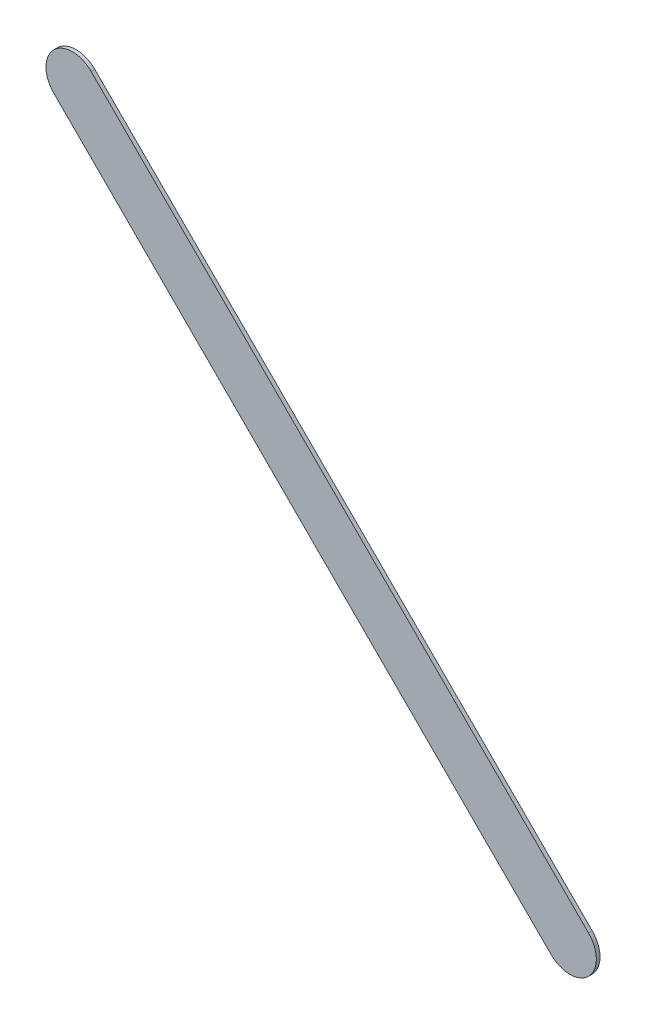
ISO-10303-21;
HEADER;
FILE_DESCRIPTION(('STEP AP214'),'2;1');
FILE_NAME('part.step','',(''),(''),'','','');
FILE_SCHEMA(('AUTOMOTIVE_DESIGN { 1 0 10303 214 1 1 1 1 }'));
ENDSEC;
DATA;
#1=APPLICATION_CONTEXT('core data for automotive mechanical design processes');
#2=APPLICATION_PROTOCOL_DEFINITION('international standard','automotive_design',2000,#1);
#3=PRODUCT_CONTEXT('',#1,'mechanical');
#4=PRODUCT('Part','Part','',(#3));
#5=PRODUCT_RELATED_PRODUCT_CATEGORY('part','',(#4));
#6=PRODUCT_DEFINITION_FORMATION('','',#4);
#7=PRODUCT_DEFINITION_CONTEXT('part definition',#1,'design');
#8=PRODUCT_DEFINITION('design','',#6,#7);
#9=PRODUCT_DEFINITION_SHAPE('','',#8);
#10=(LENGTH_UNIT() NAMED_UNIT(*) SI_UNIT(.MILLI.,.METRE.));
#11=(NAMED_UNIT(*) PLANE_ANGLE_UNIT() SI_UNIT($,.RADIAN.));
#12=(NAMED_UNIT(*) SI_UNIT($,.STERADIAN.) SOLID_ANGLE_UNIT());
#13=UNCERTAINTY_MEASURE_WITH_UNIT(LENGTH_MEASURE(1.E-05),#10,'distance_accuracy_value','');
#14=(GEOMETRIC_REPRESENTATION_CONTEXT(3) GLOBAL_UNCERTAINTY_ASSIGNED_CONTEXT((#13)) GLOBAL_UNIT_ASSIGNED_CONTEXT((#10,
#11,#12)) REPRESENTATION_CONTEXT('',''));
#15=CARTESIAN_POINT('',(0.,0.,0.));
#16=DIRECTION('',(0.,0.,1.));
#17=DIRECTION('',(1.,0.,0.));
#18=AXIS2_PLACEMENT_3D('',#15,#16,#17);
#19=CARTESIAN_POINT('',(179.627776,-89.866223,0.));
#20=DIRECTION('',(0.,0.,1.));
#21=DIRECTION('',(1.,0.,0.));
#22=AXIS2_PLACEMENT_3D('',#19,#20,#21);
#23=PLANE('',#22);
#24=DIRECTION('',(-0.707106781186548,0.707106781186548,0.));
#25=VECTOR('',#24,1.);
#26=CARTESIAN_POINT('',(179.627776,-89.866223,0.));
#27=LINE('',#26,#25);
#28=CARTESIAN_POINT('',(179.627776,-89.866223,0.));
#29=VERTEX_POINT('',#28);
#30=CARTESIAN_POINT('',(174.928776,-85.167223,0.));
#31=VERTEX_POINT('',#30);
#32=EDGE_CURVE('E82',#29,#31,#27,.T.);
#33=ORIENTED_EDGE('',*,*,#32,.T.);
#34=CARTESIAN_POINT('',(174.7519995,-85.3439995,0.));
#35=DIRECTION('',(0.,0.,1.));
#36=DIRECTION('',(0.707106781186548,0.707106781186548,0.));
#37=AXIS2_PLACEMENT_3D('',#34,#35,#36);
#38=CIRCLE('',#37,0.249999723809);
#39=CARTESIAN_POINT('',(174.575223,-85.520776,0.));
#40=VERTEX_POINT('',#39);
#41=EDGE_CURVE('E106',#31,#40,#38,.T.);
#42=ORIENTED_EDGE('',*,*,#41,.T.);
#43=DIRECTION('',(0.707106781186548,-0.707106781186548,0.));
#44=VECTOR('',#43,1.);
#45=CARTESIAN_POINT('',(174.575223,-85.520776,0.));
#46=LINE('',#45,#44);
#47=CARTESIAN_POINT('',(179.274223,-90.219776,0.));
#48=VERTEX_POINT('',#47);
#49=EDGE_CURVE('E74',#40,#48,#46,.T.);
#50=ORIENTED_EDGE('',*,*,#49,.T.);
#51=CARTESIAN_POINT('',(179.4509995,-90.0429995,0.));
#52=DIRECTION('',(0.,0.,1.));
#53=DIRECTION('',(-0.707106781187048,-0.707106781186048,0.));
#54=AXIS2_PLACEMENT_3D('',#51,#52,#53);
#55=CIRCLE('',#54,0.249999723809);
#56=EDGE_CURVE('E11',#48,#29,#55,.T.);
#57=ORIENTED_EDGE('',*,*,#56,.T.);
#58=EDGE_LOOP('',(#33,#42,#50,#57));
#59=FACE_BOUND('',#58,.T.);
#60=ADVANCED_FACE('F17',(#59),#23,.T.);
#61=CARTESIAN_POINT('',(179.627776,-89.866223,-0.035));
#62=DIRECTION('',(0.,0.,1.));
#63=DIRECTION('',(1.,0.,0.));
#64=AXIS2_PLACEMENT_3D('',#61,#62,#63);
#65=PLANE('',#64);
#66=CARTESIAN_POINT('',(179.4509995,-90.0429995,-0.035));
#67=DIRECTION('',(0.,0.,1.));
#68=DIRECTION('',(-0.707106781187048,-0.707106781186048,0.));
#69=AXIS2_PLACEMENT_3D('',#66,#67,#68);
#70=CIRCLE('',#69,0.249999723809);
#71=CARTESIAN_POINT('',(179.274223,-90.219776,-0.035));
#72=VERTEX_POINT('',#71);
#73=CARTESIAN_POINT('',(179.627776,-89.866223,-0.035));
#74=VERTEX_POINT('',#73);
#75=EDGE_CURVE('E25',#72,#74,#70,.T.);
#76=ORIENTED_EDGE('',*,*,#75,.F.);
#77=DIRECTION('',(0.707106781186548,-0.707106781186548,0.));
#78=VECTOR('',#77,1.);
#79=CARTESIAN_POINT('',(174.575223,-85.520776,-0.035));
#80=LINE('',#79,#78);
#81=CARTESIAN_POINT('',(174.575223,-85.520776,-0.035));
#82=VERTEX_POINT('',#81);
#83=EDGE_CURVE('E110',#82,#72,#80,.T.);
#84=ORIENTED_EDGE('',*,*,#83,.F.);
#85=CARTESIAN_POINT('',(174.7519995,-85.3439995,-0.035));
#86=DIRECTION('',(0.,0.,1.));
#87=DIRECTION('',(0.707106781186548,0.707106781186548,0.));
#88=AXIS2_PLACEMENT_3D('',#85,#86,#87);
#89=CIRCLE('',#88,0.249999723809);
#90=CARTESIAN_POINT('',(174.928776,-85.167223,-0.035));
#91=VERTEX_POINT('',#90);
#92=EDGE_CURVE('E84',#91,#82,#89,.T.);
#93=ORIENTED_EDGE('',*,*,#92,.F.);
#94=DIRECTION('',(-0.707106781186548,0.707106781186548,0.));
#95=VECTOR('',#94,1.);
#96=CARTESIAN_POINT('',(179.627776,-89.866223,-0.035));
#97=LINE('',#96,#95);
#98=EDGE_CURVE('E80',#74,#91,#97,.T.);
#99=ORIENTED_EDGE('',*,*,#98,.F.);
#100=EDGE_LOOP('',(#76,#84,#93,#99));
#101=FACE_BOUND('',#100,.T.);
#102=ADVANCED_FACE('F86',(#101),#65,.F.);
#103=CARTESIAN_POINT('',(179.4509995,-90.0429995,-0.035));
#104=DIRECTION('',(0.,0.,-1.));
#105=DIRECTION('',(-0.707106781187048,-0.707106781186048,0.));
#106=AXIS2_PLACEMENT_3D('',#103,#104,#105);
#107=CYLINDRICAL_SURFACE('',#106,0.249999723809);
#108=ORIENTED_EDGE('',*,*,#75,.T.);
#109=DIRECTION('',(0.,0.,1.));
#110=VECTOR('',#109,1.);
#111=CARTESIAN_POINT('',(179.627776,-89.866223,-0.035));
#112=LINE('',#111,#110);
#113=EDGE_CURVE('E68',#74,#29,#112,.T.);
#114=ORIENTED_EDGE('',*,*,#113,.T.);
#115=ORIENTED_EDGE('',*,*,#56,.F.);
#116=DIRECTION('',(0.,0.,1.));
#117=VECTOR('',#116,1.);
#118=CARTESIAN_POINT('',(179.274223,-90.219776,-0.035));
#119=LINE('',#118,#117);
#120=EDGE_CURVE('E71',#72,#48,#119,.T.);
#121=ORIENTED_EDGE('',*,*,#120,.F.);
#122=EDGE_LOOP('',(#108,#114,#115,#121));
#123=FACE_BOUND('',#122,.T.);
#124=ADVANCED_FACE('F67',(#123),#107,.T.);
#125=CARTESIAN_POINT('',(174.575223,-85.520776,-0.035));
#126=DIRECTION('',(0.707106781186548,0.707106781186548,0.));
#127=DIRECTION('',(0.,0.,-1.));
#128=AXIS2_PLACEMENT_3D('',#125,#126,#127);
#129=PLANE('',#128);
#130=ORIENTED_EDGE('',*,*,#83,.T.);
#131=ORIENTED_EDGE('',*,*,#120,.T.);
#132=ORIENTED_EDGE('',*,*,#49,.F.);
#133=DIRECTION('',(0.,0.,1.));
#134=VECTOR('',#133,1.);
#135=CARTESIAN_POINT('',(174.575223,-85.520776,-0.035));
#136=LINE('',#135,#134);
#137=EDGE_CURVE('E102',#82,#40,#136,.T.);
#138=ORIENTED_EDGE('',*,*,#137,.F.);
#139=EDGE_LOOP('',(#130,#131,#132,#138));
#140=FACE_BOUND('',#139,.T.);
#141=ADVANCED_FACE('F120',(#140),#129,.F.);
#142=CARTESIAN_POINT('',(174.7519995,-85.3439995,-0.035));
#143=DIRECTION('',(0.,0.,-1.));
#144=DIRECTION('',(0.707106781186548,0.707106781186548,0.));
#145=AXIS2_PLACEMENT_3D('',#142,#143,#144);
#146=CYLINDRICAL_SURFACE('',#145,0.249999723809);
#147=ORIENTED_EDGE('',*,*,#92,.T.);
#148=ORIENTED_EDGE('',*,*,#137,.T.);
#149=ORIENTED_EDGE('',*,*,#41,.F.);
#150=DIRECTION('',(0.,0.,1.));
#151=VECTOR('',#150,1.);
#152=CARTESIAN_POINT('',(174.928776,-85.167223,-0.035));
#153=LINE('',#152,#151);
#154=EDGE_CURVE('E90',#91,#31,#153,.T.);
#155=ORIENTED_EDGE('',*,*,#154,.F.);
#156=EDGE_LOOP('',(#147,#148,#149,#155));
#157=FACE_BOUND('',#156,.T.);
#158=ADVANCED_FACE('F122',(#157),#146,.T.);
#159=CARTESIAN_POINT('',(179.627776,-89.866223,-0.035));
#160=DIRECTION('',(-0.707106781186548,-0.707106781186548,0.));
#161=DIRECTION('',(-0.707106781186548,0.707106781186548,0.));
#162=AXIS2_PLACEMENT_3D('',#159,#160,#161);
#163=PLANE('',#162);
#164=ORIENTED_EDGE('',*,*,#98,.T.);
#165=ORIENTED_EDGE('',*,*,#154,.T.);
#166=ORIENTED_EDGE('',*,*,#32,.F.);
#167=ORIENTED_EDGE('',*,*,#113,.F.);
#168=EDGE_LOOP('',(#164,#165,#166,#167));
#169=FACE_BOUND('',#168,.T.);
#170=ADVANCED_FACE('F78',(#169),#163,.F.);
#171=CLOSED_SHELL('',(#60,#102,#124,#141,#158,#170));
#172=MANIFOLD_SOLID_BREP('B1',#171);
#173=ADVANCED_BREP_SHAPE_REPRESENTATION('',(#18,#172),#14);
#174=SHAPE_DEFINITION_REPRESENTATION(#9,#173);
ENDSEC;
END-ISO-10303-21;
